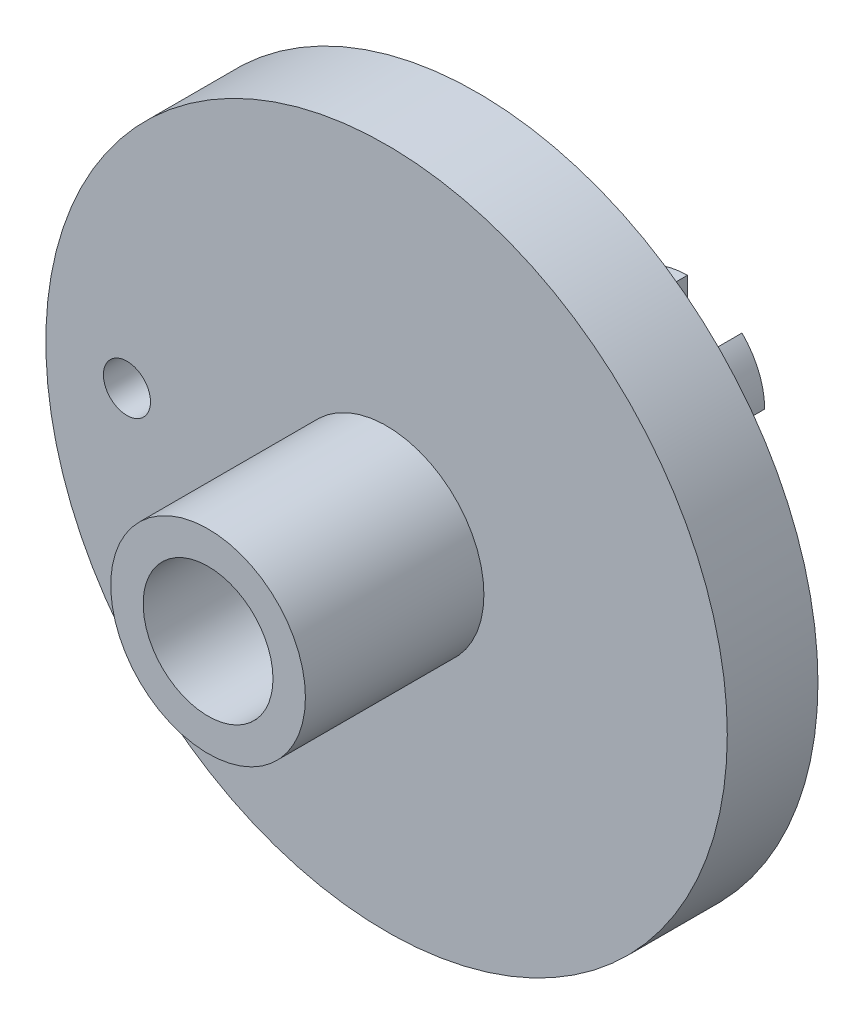
ISO-10303-21;
HEADER;
FILE_DESCRIPTION(('STEP AP214'),'2;1');
FILE_NAME('part.step','',(''),(''),'','','');
FILE_SCHEMA(('AUTOMOTIVE_DESIGN { 1 0 10303 214 1 1 1 1 }'));
ENDSEC;
DATA;
#1=APPLICATION_CONTEXT('core data for automotive mechanical design processes');
#2=APPLICATION_PROTOCOL_DEFINITION('international standard','automotive_design',2000,#1);
#3=PRODUCT_CONTEXT('',#1,'mechanical');
#4=PRODUCT('Part','Part','',(#3));
#5=PRODUCT_RELATED_PRODUCT_CATEGORY('part','',(#4));
#6=PRODUCT_DEFINITION_FORMATION('','',#4);
#7=PRODUCT_DEFINITION_CONTEXT('part definition',#1,'design');
#8=PRODUCT_DEFINITION('design','',#6,#7);
#9=PRODUCT_DEFINITION_SHAPE('','',#8);
#10=(LENGTH_UNIT() NAMED_UNIT(*) SI_UNIT(.MILLI.,.METRE.));
#11=(NAMED_UNIT(*) PLANE_ANGLE_UNIT() SI_UNIT($,.RADIAN.));
#12=(NAMED_UNIT(*) SI_UNIT($,.STERADIAN.) SOLID_ANGLE_UNIT());
#13=UNCERTAINTY_MEASURE_WITH_UNIT(LENGTH_MEASURE(1.E-05),#10,'distance_accuracy_value','');
#14=(GEOMETRIC_REPRESENTATION_CONTEXT(3) GLOBAL_UNCERTAINTY_ASSIGNED_CONTEXT((#13)) GLOBAL_UNIT_ASSIGNED_CONTEXT((#10,
#11,#12)) REPRESENTATION_CONTEXT('',''));
#15=CARTESIAN_POINT('',(0.,0.,0.));
#16=DIRECTION('',(0.,0.,1.));
#17=DIRECTION('',(1.,0.,0.));
#18=AXIS2_PLACEMENT_3D('',#15,#16,#17);
#19=CARTESIAN_POINT('',(0.,0.,0.));
#20=DIRECTION('',(0.,0.,1.));
#21=DIRECTION('',(1.,0.,0.));
#22=AXIS2_PLACEMENT_3D('',#19,#20,#21);
#23=PLANE('',#22);
#24=CARTESIAN_POINT('',(0.,0.,0.));
#25=DIRECTION('',(0.,0.,1.));
#26=DIRECTION('',(1.,0.,0.));
#27=AXIS2_PLACEMENT_3D('',#24,#25,#26);
#28=CIRCLE('',#27,1.55);
#29=CARTESIAN_POINT('',(1.55,0.,0.));
#30=VERTEX_POINT('',#29);
#31=EDGE_CURVE('E491',#30,#30,#28,.T.);
#32=ORIENTED_EDGE('',*,*,#31,.F.);
#33=EDGE_LOOP('',(#32));
#34=FACE_BOUND('',#33,.T.);
#35=CARTESIAN_POINT('',(0.,0.,0.));
#36=DIRECTION('',(0.,0.,1.));
#37=DIRECTION('',(1.,0.,0.));
#38=AXIS2_PLACEMENT_3D('',#35,#36,#37);
#39=CIRCLE('',#38,4.);
#40=CARTESIAN_POINT('',(4.,0.,0.));
#41=VERTEX_POINT('',#40);
#42=EDGE_CURVE('E340',#41,#41,#39,.F.);
#43=ORIENTED_EDGE('',*,*,#42,.F.);
#44=EDGE_LOOP('',(#43));
#45=FACE_BOUND('',#44,.T.);
#46=ADVANCED_FACE('F47',(#34,#45),#23,.T.);
#47=CARTESIAN_POINT('',(0.,0.,-16.));
#48=DIRECTION('',(0.,0.,1.));
#49=DIRECTION('',(1.,0.,0.));
#50=AXIS2_PLACEMENT_3D('',#47,#48,#49);
#51=PLANE('',#50);
#52=CARTESIAN_POINT('',(0.,0.,-16.));
#53=DIRECTION('',(0.,0.,1.));
#54=DIRECTION('',(1.,0.,0.));
#55=AXIS2_PLACEMENT_3D('',#52,#53,#54);
#56=CIRCLE('',#55,1.55);
#57=CARTESIAN_POINT('',(1.55,0.,-16.));
#58=VERTEX_POINT('',#57);
#59=EDGE_CURVE('E193',#58,#58,#56,.T.);
#60=ORIENTED_EDGE('',*,*,#59,.T.);
#61=EDGE_LOOP('',(#60));
#62=FACE_BOUND('',#61,.T.);
#63=DIRECTION('',(0.707106781186551,-0.707106781186544,0.));
#64=VECTOR('',#63,1.);
#65=CARTESIAN_POINT('',(0.,0.,-16.));
#66=LINE('',#65,#64);
#67=CARTESIAN_POINT('',(1.97989898732234,-1.97989898732232,-16.));
#68=VERTEX_POINT('',#67);
#69=CARTESIAN_POINT('',(3.36759604540095,-3.36759604540092,-16.));
#70=VERTEX_POINT('',#69);
#71=EDGE_CURVE('E190',#68,#70,#66,.T.);
#72=ORIENTED_EDGE('',*,*,#71,.F.);
#73=CARTESIAN_POINT('',(0.,0.,-16.));
#74=DIRECTION('',(0.,0.,-1.));
#75=DIRECTION('',(-1.,0.,0.));
#76=AXIS2_PLACEMENT_3D('',#73,#74,#75);
#77=CIRCLE('',#76,2.8);
#78=CARTESIAN_POINT('',(0.,-2.8,-16.));
#79=VERTEX_POINT('',#78);
#80=EDGE_CURVE('E169',#68,#79,#77,.T.);
#81=ORIENTED_EDGE('',*,*,#80,.T.);
#82=DIRECTION('',(0.,1.,0.));
#83=VECTOR('',#82,1.);
#84=CARTESIAN_POINT('',(0.,0.,-16.));
#85=LINE('',#84,#83);
#86=CARTESIAN_POINT('',(0.,-4.7625,-16.));
#87=VERTEX_POINT('',#86);
#88=EDGE_CURVE('E186',#87,#79,#85,.T.);
#89=ORIENTED_EDGE('',*,*,#88,.F.);
#90=CARTESIAN_POINT('',(0.,0.,-16.));
#91=DIRECTION('',(0.,0.,1.));
#92=DIRECTION('',(1.,0.,0.));
#93=AXIS2_PLACEMENT_3D('',#90,#91,#92);
#94=CIRCLE('',#93,4.7625);
#95=CARTESIAN_POINT('',(-3.36759604540093,-3.36759604540094,-16.));
#96=VERTEX_POINT('',#95);
#97=EDGE_CURVE('E504',#96,#87,#94,.T.);
#98=ORIENTED_EDGE('',*,*,#97,.F.);
#99=DIRECTION('',(-0.707106781186546,-0.707106781186549,0.));
#100=VECTOR('',#99,1.);
#101=CARTESIAN_POINT('',(0.,0.,-16.));
#102=LINE('',#101,#100);
#103=CARTESIAN_POINT('',(-1.97989898732233,-1.97989898732234,-16.));
#104=VERTEX_POINT('',#103);
#105=EDGE_CURVE('E231',#104,#96,#102,.T.);
#106=ORIENTED_EDGE('',*,*,#105,.F.);
#107=CARTESIAN_POINT('',(0.,0.,-16.));
#108=DIRECTION('',(0.,0.,-1.));
#109=DIRECTION('',(-1.,0.,0.));
#110=AXIS2_PLACEMENT_3D('',#107,#108,#109);
#111=CIRCLE('',#110,2.8);
#112=CARTESIAN_POINT('',(-2.8,0.,-16.));
#113=VERTEX_POINT('',#112);
#114=EDGE_CURVE('E173',#104,#113,#111,.T.);
#115=ORIENTED_EDGE('',*,*,#114,.T.);
#116=DIRECTION('',(-1.,0.,0.));
#117=VECTOR('',#116,1.);
#118=CARTESIAN_POINT('',(0.,0.,-16.));
#119=LINE('',#118,#117);
#120=CARTESIAN_POINT('',(-4.7625,0.,-16.));
#121=VERTEX_POINT('',#120);
#122=EDGE_CURVE('E217',#113,#121,#119,.T.);
#123=ORIENTED_EDGE('',*,*,#122,.T.);
#124=CARTESIAN_POINT('',(-3.36759604540095,3.36759604540091,-16.));
#125=VERTEX_POINT('',#124);
#126=EDGE_CURVE('E341',#125,#121,#94,.T.);
#127=ORIENTED_EDGE('',*,*,#126,.F.);
#128=DIRECTION('',(0.707106781186551,-0.707106781186544,0.));
#129=VECTOR('',#128,1.);
#130=CARTESIAN_POINT('',(0.,0.,-16.));
#131=LINE('',#130,#129);
#132=CARTESIAN_POINT('',(-1.97989898732234,1.97989898732232,-16.));
#133=VERTEX_POINT('',#132);
#134=EDGE_CURVE('E268',#125,#133,#131,.T.);
#135=ORIENTED_EDGE('',*,*,#134,.T.);
#136=CARTESIAN_POINT('',(0.,0.,-16.));
#137=DIRECTION('',(0.,0.,-1.));
#138=DIRECTION('',(-1.,0.,0.));
#139=AXIS2_PLACEMENT_3D('',#136,#137,#138);
#140=CIRCLE('',#139,2.8);
#141=CARTESIAN_POINT('',(0.,2.8,-16.));
#142=VERTEX_POINT('',#141);
#143=EDGE_CURVE('E247',#133,#142,#140,.T.);
#144=ORIENTED_EDGE('',*,*,#143,.T.);
#145=DIRECTION('',(0.,1.,0.));
#146=VECTOR('',#145,1.);
#147=CARTESIAN_POINT('',(0.,0.,-16.));
#148=LINE('',#147,#146);
#149=CARTESIAN_POINT('',(0.,4.7625,-16.));
#150=VERTEX_POINT('',#149);
#151=EDGE_CURVE('E253',#142,#150,#148,.T.);
#152=ORIENTED_EDGE('',*,*,#151,.T.);
#153=CARTESIAN_POINT('',(3.36759604540093,3.36759604540094,-16.));
#154=VERTEX_POINT('',#153);
#155=EDGE_CURVE('E336',#154,#150,#94,.T.);
#156=ORIENTED_EDGE('',*,*,#155,.F.);
#157=DIRECTION('',(-0.707106781186546,-0.707106781186549,0.));
#158=VECTOR('',#157,1.);
#159=CARTESIAN_POINT('',(0.,0.,-16.));
#160=LINE('',#159,#158);
#161=CARTESIAN_POINT('',(1.97989898732233,1.97989898732234,-16.));
#162=VERTEX_POINT('',#161);
#163=EDGE_CURVE('E307',#154,#162,#160,.T.);
#164=ORIENTED_EDGE('',*,*,#163,.T.);
#165=CARTESIAN_POINT('',(0.,0.,-16.));
#166=DIRECTION('',(0.,0.,-1.));
#167=DIRECTION('',(-1.,0.,0.));
#168=AXIS2_PLACEMENT_3D('',#165,#166,#167);
#169=CIRCLE('',#168,2.8);
#170=CARTESIAN_POINT('',(2.8,0.,-16.));
#171=VERTEX_POINT('',#170);
#172=EDGE_CURVE('E287',#162,#171,#169,.T.);
#173=ORIENTED_EDGE('',*,*,#172,.T.);
#174=DIRECTION('',(-1.,0.,0.));
#175=VECTOR('',#174,1.);
#176=CARTESIAN_POINT('',(0.,0.,-16.));
#177=LINE('',#176,#175);
#178=CARTESIAN_POINT('',(4.7625,0.,-16.));
#179=VERTEX_POINT('',#178);
#180=EDGE_CURVE('E293',#179,#171,#177,.T.);
#181=ORIENTED_EDGE('',*,*,#180,.F.);
#182=EDGE_CURVE('E332',#70,#179,#94,.T.);
#183=ORIENTED_EDGE('',*,*,#182,.F.);
#184=EDGE_LOOP('',(#72,#81,#89,#98,#106,#115,#123,#127,#135,#144,#152,#156,#164,#173,#181,#183));
#185=FACE_BOUND('',#184,.T.);
#186=ADVANCED_FACE('F362',(#62,#185),#51,.F.);
#187=CARTESIAN_POINT('',(0.,0.,-16.));
#188=DIRECTION('',(0.,0.,1.));
#189=DIRECTION('',(1.,0.,0.));
#190=AXIS2_PLACEMENT_3D('',#187,#188,#189);
#191=CYLINDRICAL_SURFACE('',#190,4.7625);
#192=CARTESIAN_POINT('',(0.,0.,-7.588));
#193=DIRECTION('',(0.,0.,1.));
#194=DIRECTION('',(1.,0.,0.));
#195=AXIS2_PLACEMENT_3D('',#192,#193,#194);
#196=CIRCLE('',#195,4.7625);
#197=CARTESIAN_POINT('',(4.7625,0.,-7.588));
#198=VERTEX_POINT('',#197);
#199=EDGE_CURVE('E56',#198,#198,#196,.F.);
#200=ORIENTED_EDGE('',*,*,#199,.T.);
#201=EDGE_LOOP('',(#200));
#202=FACE_BOUND('',#201,.T.);
#203=ORIENTED_EDGE('',*,*,#155,.T.);
#204=DIRECTION('',(0.,0.,1.));
#205=VECTOR('',#204,1.);
#206=CARTESIAN_POINT('',(0.,4.7625,-18.54));
#207=LINE('',#206,#205);
#208=CARTESIAN_POINT('',(0.,4.7625,-18.54));
#209=VERTEX_POINT('',#208);
#210=EDGE_CURVE('E277',#209,#150,#207,.T.);
#211=ORIENTED_EDGE('',*,*,#210,.F.);
#212=CARTESIAN_POINT('',(0.,0.,-18.54));
#213=DIRECTION('',(0.,0.,-1.));
#214=DIRECTION('',(-1.,0.,0.));
#215=AXIS2_PLACEMENT_3D('',#212,#213,#214);
#216=CIRCLE('',#215,4.7625);
#217=CARTESIAN_POINT('',(-3.36759604540095,3.36759604540091,-18.54));
#218=VERTEX_POINT('',#217);
#219=EDGE_CURVE('E257',#218,#209,#216,.T.);
#220=ORIENTED_EDGE('',*,*,#219,.F.);
#221=DIRECTION('',(0.,0.,1.));
#222=VECTOR('',#221,1.);
#223=CARTESIAN_POINT('',(-3.36759604540095,3.36759604540091,-18.54));
#224=LINE('',#223,#222);
#225=EDGE_CURVE('E280',#218,#125,#224,.T.);
#226=ORIENTED_EDGE('',*,*,#225,.T.);
#227=ORIENTED_EDGE('',*,*,#126,.T.);
#228=DIRECTION('',(0.,0.,1.));
#229=VECTOR('',#228,1.);
#230=CARTESIAN_POINT('',(-4.7625,0.,-18.54));
#231=LINE('',#230,#229);
#232=CARTESIAN_POINT('',(-4.7625,0.,-18.54));
#233=VERTEX_POINT('',#232);
#234=EDGE_CURVE('E239',#233,#121,#231,.T.);
#235=ORIENTED_EDGE('',*,*,#234,.F.);
#236=CARTESIAN_POINT('',(0.,0.,-18.54));
#237=DIRECTION('',(0.,0.,-1.));
#238=DIRECTION('',(-1.,0.,0.));
#239=AXIS2_PLACEMENT_3D('',#236,#237,#238);
#240=CIRCLE('',#239,4.7625);
#241=CARTESIAN_POINT('',(-3.36759604540093,-3.36759604540094,-18.54));
#242=VERTEX_POINT('',#241);
#243=EDGE_CURVE('E220',#242,#233,#240,.T.);
#244=ORIENTED_EDGE('',*,*,#243,.F.);
#245=DIRECTION('',(0.,0.,1.));
#246=VECTOR('',#245,1.);
#247=CARTESIAN_POINT('',(-3.36759604540093,-3.36759604540094,-18.54));
#248=LINE('',#247,#246);
#249=EDGE_CURVE('E70',#242,#96,#248,.T.);
#250=ORIENTED_EDGE('',*,*,#249,.T.);
#251=ORIENTED_EDGE('',*,*,#97,.T.);
#252=DIRECTION('',(0.,0.,1.));
#253=VECTOR('',#252,1.);
#254=CARTESIAN_POINT('',(0.,-4.7625,-18.54));
#255=LINE('',#254,#253);
#256=CARTESIAN_POINT('',(0.,-4.7625,-18.54));
#257=VERTEX_POINT('',#256);
#258=EDGE_CURVE('E207',#257,#87,#255,.T.);
#259=ORIENTED_EDGE('',*,*,#258,.F.);
#260=CARTESIAN_POINT('',(0.,0.,-18.54));
#261=DIRECTION('',(0.,0.,-1.));
#262=DIRECTION('',(-1.,0.,0.));
#263=AXIS2_PLACEMENT_3D('',#260,#261,#262);
#264=CIRCLE('',#263,4.7625);
#265=CARTESIAN_POINT('',(3.36759604540095,-3.36759604540092,-18.54));
#266=VERTEX_POINT('',#265);
#267=EDGE_CURVE('E179',#266,#257,#264,.T.);
#268=ORIENTED_EDGE('',*,*,#267,.F.);
#269=DIRECTION('',(0.,0.,1.));
#270=VECTOR('',#269,1.);
#271=CARTESIAN_POINT('',(3.36759604540095,-3.36759604540092,-18.54));
#272=LINE('',#271,#270);
#273=EDGE_CURVE('E63',#266,#70,#272,.T.);
#274=ORIENTED_EDGE('',*,*,#273,.T.);
#275=ORIENTED_EDGE('',*,*,#182,.T.);
#276=DIRECTION('',(0.,0.,1.));
#277=VECTOR('',#276,1.);
#278=CARTESIAN_POINT('',(4.7625,0.,-18.54));
#279=LINE('',#278,#277);
#280=CARTESIAN_POINT('',(4.7625,0.,-18.54));
#281=VERTEX_POINT('',#280);
#282=EDGE_CURVE('E316',#281,#179,#279,.T.);
#283=ORIENTED_EDGE('',*,*,#282,.F.);
#284=CARTESIAN_POINT('',(0.,0.,-18.54));
#285=DIRECTION('',(0.,0.,-1.));
#286=DIRECTION('',(-1.,0.,0.));
#287=AXIS2_PLACEMENT_3D('',#284,#285,#286);
#288=CIRCLE('',#287,4.7625);
#289=CARTESIAN_POINT('',(3.36759604540093,3.36759604540094,-18.54));
#290=VERTEX_POINT('',#289);
#291=EDGE_CURVE('E297',#290,#281,#288,.T.);
#292=ORIENTED_EDGE('',*,*,#291,.F.);
#293=DIRECTION('',(0.,0.,1.));
#294=VECTOR('',#293,1.);
#295=CARTESIAN_POINT('',(3.36759604540093,3.36759604540094,-18.54));
#296=LINE('',#295,#294);
#297=EDGE_CURVE('E320',#290,#154,#296,.T.);
#298=ORIENTED_EDGE('',*,*,#297,.T.);
#299=EDGE_LOOP('',(#203,#211,#220,#226,#227,#235,#244,#250,#251,#259,#268,#274,#275,#283,#292,#298));
#300=FACE_BOUND('',#299,.T.);
#301=ADVANCED_FACE('F348',(#202,#300),#191,.T.);
#302=CARTESIAN_POINT('',(0.,0.,-5.588));
#303=DIRECTION('',(0.,0.,1.));
#304=DIRECTION('',(1.,0.,0.));
#305=AXIS2_PLACEMENT_3D('',#302,#303,#304);
#306=CYLINDRICAL_SURFACE('',#305,21.);
#307=CARTESIAN_POINT('',(0.,0.,-5.588));
#308=DIRECTION('',(0.,0.,1.));
#309=DIRECTION('',(1.,0.,0.));
#310=AXIS2_PLACEMENT_3D('',#307,#308,#309);
#311=CIRCLE('',#310,21.);
#312=CARTESIAN_POINT('',(21.,0.,-5.588));
#313=VERTEX_POINT('',#312);
#314=EDGE_CURVE('E328',#313,#313,#311,.T.);
#315=ORIENTED_EDGE('',*,*,#314,.T.);
#316=EDGE_LOOP('',(#315));
#317=FACE_BOUND('',#316,.T.);
#318=CARTESIAN_POINT('',(0.,0.,0.));
#319=DIRECTION('',(0.,0.,1.));
#320=DIRECTION('',(1.,0.,0.));
#321=AXIS2_PLACEMENT_3D('',#318,#319,#320);
#322=CIRCLE('',#321,21.);
#323=CARTESIAN_POINT('',(21.,0.,0.));
#324=VERTEX_POINT('',#323);
#325=EDGE_CURVE('E327',#324,#324,#322,.T.);
#326=ORIENTED_EDGE('',*,*,#325,.F.);
#327=EDGE_LOOP('',(#326));
#328=FACE_BOUND('',#327,.T.);
#329=ADVANCED_FACE('F385',(#317,#328),#306,.T.);
#330=CARTESIAN_POINT('',(0.,0.,-5.588));
#331=DIRECTION('',(0.,0.,1.));
#332=DIRECTION('',(1.,0.,0.));
#333=AXIS2_PLACEMENT_3D('',#330,#331,#332);
#334=PLANE('',#333);
#335=CARTESIAN_POINT('',(0.,0.,-5.588));
#336=DIRECTION('',(0.,0.,1.));
#337=DIRECTION('',(1.,0.,0.));
#338=AXIS2_PLACEMENT_3D('',#335,#336,#337);
#339=CIRCLE('',#338,6.7625);
#340=CARTESIAN_POINT('',(6.7625,0.,-5.588));
#341=VERTEX_POINT('',#340);
#342=EDGE_CURVE('E11',#341,#341,#339,.T.);
#343=ORIENTED_EDGE('',*,*,#342,.T.);
#344=EDGE_LOOP('',(#343));
#345=FACE_BOUND('',#344,.T.);
#346=CARTESIAN_POINT('',(-16.,0.,-5.588));
#347=DIRECTION('',(0.,0.,1.));
#348=DIRECTION('',(1.,0.,0.));
#349=AXIS2_PLACEMENT_3D('',#346,#347,#348);
#350=CIRCLE('',#349,1.45);
#351=CARTESIAN_POINT('',(-14.55,0.,-5.588));
#352=VERTEX_POINT('',#351);
#353=EDGE_CURVE('E488',#352,#352,#350,.T.);
#354=ORIENTED_EDGE('',*,*,#353,.T.);
#355=EDGE_LOOP('',(#354));
#356=FACE_BOUND('',#355,.T.);
#357=ORIENTED_EDGE('',*,*,#314,.F.);
#358=EDGE_LOOP('',(#357));
#359=FACE_BOUND('',#358,.T.);
#360=ADVANCED_FACE('F376',(#345,#356,#359),#334,.F.);
#361=CARTESIAN_POINT('',(0.,0.,0.));
#362=DIRECTION('',(0.,0.,1.));
#363=DIRECTION('',(1.,0.,0.));
#364=AXIS2_PLACEMENT_3D('',#361,#362,#363);
#365=CIRCLE('',#364,6.);
#366=CARTESIAN_POINT('',(6.,0.,0.));
#367=VERTEX_POINT('',#366);
#368=EDGE_CURVE('E391',#367,#367,#365,.T.);
#369=ORIENTED_EDGE('',*,*,#368,.F.);
#370=EDGE_LOOP('',(#369));
#371=FACE_BOUND('',#370,.T.);
#372=CARTESIAN_POINT('',(-16.,0.,0.));
#373=DIRECTION('',(0.,0.,1.));
#374=DIRECTION('',(1.,0.,0.));
#375=AXIS2_PLACEMENT_3D('',#372,#373,#374);
#376=CIRCLE('',#375,1.45);
#377=CARTESIAN_POINT('',(-14.55,0.,0.));
#378=VERTEX_POINT('',#377);
#379=EDGE_CURVE('E395',#378,#378,#376,.T.);
#380=ORIENTED_EDGE('',*,*,#379,.F.);
#381=EDGE_LOOP('',(#380));
#382=FACE_BOUND('',#381,.T.);
#383=ORIENTED_EDGE('',*,*,#325,.T.);
#384=EDGE_LOOP('',(#383));
#385=FACE_BOUND('',#384,.T.);
#386=ADVANCED_FACE('F365',(#371,#382,#385),#23,.T.);
#387=CARTESIAN_POINT('',(0.,0.,-18.54));
#388=DIRECTION('',(0.,0.,1.));
#389=DIRECTION('',(1.,0.,0.));
#390=AXIS2_PLACEMENT_3D('',#387,#388,#389);
#391=CYLINDRICAL_SURFACE('',#390,2.8);
#392=ORIENTED_EDGE('',*,*,#172,.F.);
#393=DIRECTION('',(0.,0.,1.));
#394=VECTOR('',#393,1.);
#395=CARTESIAN_POINT('',(1.97989898732233,1.97989898732234,-18.54));
#396=LINE('',#395,#394);
#397=CARTESIAN_POINT('',(1.97989898732233,1.97989898732234,-18.54));
#398=VERTEX_POINT('',#397);
#399=EDGE_CURVE('E323',#398,#162,#396,.T.);
#400=ORIENTED_EDGE('',*,*,#399,.F.);
#401=CARTESIAN_POINT('',(0.,0.,-18.54));
#402=DIRECTION('',(0.,0.,-1.));
#403=DIRECTION('',(-1.,0.,0.));
#404=AXIS2_PLACEMENT_3D('',#401,#402,#403);
#405=CIRCLE('',#404,2.8);
#406=CARTESIAN_POINT('',(2.8,0.,-18.54));
#407=VERTEX_POINT('',#406);
#408=EDGE_CURVE('E288',#398,#407,#405,.T.);
#409=ORIENTED_EDGE('',*,*,#408,.T.);
#410=DIRECTION('',(0.,0.,1.));
#411=VECTOR('',#410,1.);
#412=CARTESIAN_POINT('',(2.8,0.,-18.54));
#413=LINE('',#412,#411);
#414=EDGE_CURVE('E303',#407,#171,#413,.T.);
#415=ORIENTED_EDGE('',*,*,#414,.T.);
#416=EDGE_LOOP('',(#392,#400,#409,#415));
#417=FACE_BOUND('',#416,.T.);
#418=ADVANCED_FACE('F375',(#417),#391,.F.);
#419=CARTESIAN_POINT('',(0.,0.,-18.54));
#420=DIRECTION('',(-0.707106781186549,0.707106781186546,0.));
#421=DIRECTION('',(-0.707106781186546,-0.707106781186549,0.));
#422=AXIS2_PLACEMENT_3D('',#419,#420,#421);
#423=PLANE('',#422);
#424=ORIENTED_EDGE('',*,*,#163,.F.);
#425=ORIENTED_EDGE('',*,*,#297,.F.);
#426=DIRECTION('',(-0.707106781186546,-0.707106781186549,0.));
#427=VECTOR('',#426,1.);
#428=CARTESIAN_POINT('',(0.,0.,-18.54));
#429=LINE('',#428,#427);
#430=EDGE_CURVE('E292',#290,#398,#429,.T.);
#431=ORIENTED_EDGE('',*,*,#430,.T.);
#432=ORIENTED_EDGE('',*,*,#399,.T.);
#433=EDGE_LOOP('',(#424,#425,#431,#432));
#434=FACE_BOUND('',#433,.T.);
#435=ADVANCED_FACE('F382',(#434),#423,.T.);
#436=CARTESIAN_POINT('',(0.,0.,-18.54));
#437=DIRECTION('',(0.,1.,0.));
#438=DIRECTION('',(0.,0.,1.));
#439=AXIS2_PLACEMENT_3D('',#436,#437,#438);
#440=PLANE('',#439);
#441=ORIENTED_EDGE('',*,*,#180,.T.);
#442=ORIENTED_EDGE('',*,*,#414,.F.);
#443=DIRECTION('',(-1.,0.,0.));
#444=VECTOR('',#443,1.);
#445=CARTESIAN_POINT('',(0.,0.,-18.54));
#446=LINE('',#445,#444);
#447=EDGE_CURVE('E300',#281,#407,#446,.T.);
#448=ORIENTED_EDGE('',*,*,#447,.F.);
#449=ORIENTED_EDGE('',*,*,#282,.T.);
#450=EDGE_LOOP('',(#441,#442,#448,#449));
#451=FACE_BOUND('',#450,.T.);
#452=ADVANCED_FACE('F407',(#451),#440,.F.);
#453=CARTESIAN_POINT('',(0.,0.,-18.54));
#454=DIRECTION('',(0.,0.,-1.));
#455=DIRECTION('',(-1.,0.,0.));
#456=AXIS2_PLACEMENT_3D('',#453,#454,#455);
#457=PLANE('',#456);
#458=ORIENTED_EDGE('',*,*,#408,.F.);
#459=ORIENTED_EDGE('',*,*,#430,.F.);
#460=ORIENTED_EDGE('',*,*,#291,.T.);
#461=ORIENTED_EDGE('',*,*,#447,.T.);
#462=EDGE_LOOP('',(#458,#459,#460,#461));
#463=FACE_BOUND('',#462,.T.);
#464=ADVANCED_FACE('F411',(#463),#457,.T.);
#465=CARTESIAN_POINT('',(0.,0.,-18.54));
#466=DIRECTION('',(0.,0.,1.));
#467=DIRECTION('',(1.,0.,0.));
#468=AXIS2_PLACEMENT_3D('',#465,#466,#467);
#469=CYLINDRICAL_SURFACE('',#468,2.8);
#470=ORIENTED_EDGE('',*,*,#143,.F.);
#471=DIRECTION('',(0.,0.,1.));
#472=VECTOR('',#471,1.);
#473=CARTESIAN_POINT('',(-1.97989898732234,1.97989898732232,-18.54));
#474=LINE('',#473,#472);
#475=CARTESIAN_POINT('',(-1.97989898732234,1.97989898732232,-18.54));
#476=VERTEX_POINT('',#475);
#477=EDGE_CURVE('E284',#476,#133,#474,.T.);
#478=ORIENTED_EDGE('',*,*,#477,.F.);
#479=CARTESIAN_POINT('',(0.,0.,-18.54));
#480=DIRECTION('',(0.,0.,-1.));
#481=DIRECTION('',(-1.,0.,0.));
#482=AXIS2_PLACEMENT_3D('',#479,#480,#481);
#483=CIRCLE('',#482,2.8);
#484=CARTESIAN_POINT('',(0.,2.8,-18.54));
#485=VERTEX_POINT('',#484);
#486=EDGE_CURVE('E248',#476,#485,#483,.T.);
#487=ORIENTED_EDGE('',*,*,#486,.T.);
#488=DIRECTION('',(0.,0.,1.));
#489=VECTOR('',#488,1.);
#490=CARTESIAN_POINT('',(0.,2.8,-18.54));
#491=LINE('',#490,#489);
#492=EDGE_CURVE('E264',#485,#142,#491,.T.);
#493=ORIENTED_EDGE('',*,*,#492,.T.);
#494=EDGE_LOOP('',(#470,#478,#487,#493));
#495=FACE_BOUND('',#494,.T.);
#496=ADVANCED_FACE('F415',(#495),#469,.F.);
#497=CARTESIAN_POINT('',(0.,0.,-18.54));
#498=DIRECTION('',(-0.707106781186544,-0.707106781186551,0.));
#499=DIRECTION('',(0.707106781186551,-0.707106781186544,0.));
#500=AXIS2_PLACEMENT_3D('',#497,#498,#499);
#501=PLANE('',#500);
#502=ORIENTED_EDGE('',*,*,#134,.F.);
#503=ORIENTED_EDGE('',*,*,#225,.F.);
#504=DIRECTION('',(0.707106781186551,-0.707106781186544,0.));
#505=VECTOR('',#504,1.);
#506=CARTESIAN_POINT('',(0.,0.,-18.54));
#507=LINE('',#506,#505);
#508=EDGE_CURVE('E252',#218,#476,#507,.T.);
#509=ORIENTED_EDGE('',*,*,#508,.T.);
#510=ORIENTED_EDGE('',*,*,#477,.T.);
#511=EDGE_LOOP('',(#502,#503,#509,#510));
#512=FACE_BOUND('',#511,.T.);
#513=ADVANCED_FACE('F419',(#512),#501,.T.);
#514=CARTESIAN_POINT('',(0.,0.,-18.54));
#515=DIRECTION('',(1.,0.,0.));
#516=DIRECTION('',(0.,0.,-1.));
#517=AXIS2_PLACEMENT_3D('',#514,#515,#516);
#518=PLANE('',#517);
#519=ORIENTED_EDGE('',*,*,#151,.F.);
#520=ORIENTED_EDGE('',*,*,#492,.F.);
#521=DIRECTION('',(0.,1.,0.));
#522=VECTOR('',#521,1.);
#523=CARTESIAN_POINT('',(0.,0.,-18.54));
#524=LINE('',#523,#522);
#525=EDGE_CURVE('E260',#485,#209,#524,.T.);
#526=ORIENTED_EDGE('',*,*,#525,.T.);
#527=ORIENTED_EDGE('',*,*,#210,.T.);
#528=EDGE_LOOP('',(#519,#520,#526,#527));
#529=FACE_BOUND('',#528,.T.);
#530=ADVANCED_FACE('F423',(#529),#518,.T.);
#531=CARTESIAN_POINT('',(0.,0.,-18.54));
#532=DIRECTION('',(0.,0.,-1.));
#533=DIRECTION('',(-1.,0.,0.));
#534=AXIS2_PLACEMENT_3D('',#531,#532,#533);
#535=PLANE('',#534);
#536=ORIENTED_EDGE('',*,*,#486,.F.);
#537=ORIENTED_EDGE('',*,*,#508,.F.);
#538=ORIENTED_EDGE('',*,*,#219,.T.);
#539=ORIENTED_EDGE('',*,*,#525,.F.);
#540=EDGE_LOOP('',(#536,#537,#538,#539));
#541=FACE_BOUND('',#540,.T.);
#542=ADVANCED_FACE('F427',(#541),#535,.T.);
#543=CARTESIAN_POINT('',(0.,0.,-18.54));
#544=DIRECTION('',(0.,0.,1.));
#545=DIRECTION('',(1.,0.,0.));
#546=AXIS2_PLACEMENT_3D('',#543,#544,#545);
#547=CYLINDRICAL_SURFACE('',#546,2.8);
#548=ORIENTED_EDGE('',*,*,#114,.F.);
#549=DIRECTION('',(0.,0.,1.));
#550=VECTOR('',#549,1.);
#551=CARTESIAN_POINT('',(-1.97989898732233,-1.97989898732234,-18.54));
#552=LINE('',#551,#550);
#553=CARTESIAN_POINT('',(-1.97989898732233,-1.97989898732234,-18.54));
#554=VERTEX_POINT('',#553);
#555=EDGE_CURVE('E244',#554,#104,#552,.T.);
#556=ORIENTED_EDGE('',*,*,#555,.F.);
#557=CARTESIAN_POINT('',(0.,0.,-18.54));
#558=DIRECTION('',(0.,0.,-1.));
#559=DIRECTION('',(-1.,0.,0.));
#560=AXIS2_PLACEMENT_3D('',#557,#558,#559);
#561=CIRCLE('',#560,2.8);
#562=CARTESIAN_POINT('',(-2.8,0.,-18.54));
#563=VERTEX_POINT('',#562);
#564=EDGE_CURVE('E212',#554,#563,#561,.T.);
#565=ORIENTED_EDGE('',*,*,#564,.T.);
#566=DIRECTION('',(0.,0.,1.));
#567=VECTOR('',#566,1.);
#568=CARTESIAN_POINT('',(-2.8,0.,-18.54));
#569=LINE('',#568,#567);
#570=EDGE_CURVE('E227',#563,#113,#569,.T.);
#571=ORIENTED_EDGE('',*,*,#570,.T.);
#572=EDGE_LOOP('',(#548,#556,#565,#571));
#573=FACE_BOUND('',#572,.T.);
#574=ADVANCED_FACE('F431',(#573),#547,.F.);
#575=CARTESIAN_POINT('',(0.,0.,-18.54));
#576=DIRECTION('',(-0.707106781186549,0.707106781186546,0.));
#577=DIRECTION('',(-0.707106781186546,-0.707106781186549,0.));
#578=AXIS2_PLACEMENT_3D('',#575,#576,#577);
#579=PLANE('',#578);
#580=ORIENTED_EDGE('',*,*,#105,.T.);
#581=ORIENTED_EDGE('',*,*,#249,.F.);
#582=DIRECTION('',(-0.707106781186546,-0.707106781186549,0.));
#583=VECTOR('',#582,1.);
#584=CARTESIAN_POINT('',(0.,0.,-18.54));
#585=LINE('',#584,#583);
#586=EDGE_CURVE('E216',#554,#242,#585,.T.);
#587=ORIENTED_EDGE('',*,*,#586,.F.);
#588=ORIENTED_EDGE('',*,*,#555,.T.);
#589=EDGE_LOOP('',(#580,#581,#587,#588));
#590=FACE_BOUND('',#589,.T.);
#591=ADVANCED_FACE('F435',(#590),#579,.F.);
#592=CARTESIAN_POINT('',(0.,0.,-18.54));
#593=DIRECTION('',(0.,1.,0.));
#594=DIRECTION('',(0.,0.,1.));
#595=AXIS2_PLACEMENT_3D('',#592,#593,#594);
#596=PLANE('',#595);
#597=ORIENTED_EDGE('',*,*,#122,.F.);
#598=ORIENTED_EDGE('',*,*,#570,.F.);
#599=DIRECTION('',(-1.,0.,0.));
#600=VECTOR('',#599,1.);
#601=CARTESIAN_POINT('',(0.,0.,-18.54));
#602=LINE('',#601,#600);
#603=EDGE_CURVE('E223',#563,#233,#602,.T.);
#604=ORIENTED_EDGE('',*,*,#603,.T.);
#605=ORIENTED_EDGE('',*,*,#234,.T.);
#606=EDGE_LOOP('',(#597,#598,#604,#605));
#607=FACE_BOUND('',#606,.T.);
#608=ADVANCED_FACE('F439',(#607),#596,.T.);
#609=CARTESIAN_POINT('',(0.,0.,-18.54));
#610=DIRECTION('',(0.,0.,-1.));
#611=DIRECTION('',(-1.,0.,0.));
#612=AXIS2_PLACEMENT_3D('',#609,#610,#611);
#613=PLANE('',#612);
#614=ORIENTED_EDGE('',*,*,#564,.F.);
#615=ORIENTED_EDGE('',*,*,#586,.T.);
#616=ORIENTED_EDGE('',*,*,#243,.T.);
#617=ORIENTED_EDGE('',*,*,#603,.F.);
#618=EDGE_LOOP('',(#614,#615,#616,#617));
#619=FACE_BOUND('',#618,.T.);
#620=ADVANCED_FACE('F443',(#619),#613,.T.);
#621=CARTESIAN_POINT('',(0.,0.,-18.54));
#622=DIRECTION('',(0.,0.,1.));
#623=DIRECTION('',(1.,0.,0.));
#624=AXIS2_PLACEMENT_3D('',#621,#622,#623);
#625=CYLINDRICAL_SURFACE('',#624,2.8);
#626=ORIENTED_EDGE('',*,*,#80,.F.);
#627=DIRECTION('',(0.,0.,1.));
#628=VECTOR('',#627,1.);
#629=CARTESIAN_POINT('',(1.97989898732234,-1.97989898732232,-18.54));
#630=LINE('',#629,#628);
#631=CARTESIAN_POINT('',(1.97989898732234,-1.97989898732232,-18.54));
#632=VERTEX_POINT('',#631);
#633=EDGE_CURVE('E163',#632,#68,#630,.T.);
#634=ORIENTED_EDGE('',*,*,#633,.F.);
#635=CARTESIAN_POINT('',(0.,0.,-18.54));
#636=DIRECTION('',(0.,0.,-1.));
#637=DIRECTION('',(-1.,0.,0.));
#638=AXIS2_PLACEMENT_3D('',#635,#636,#637);
#639=CIRCLE('',#638,2.8);
#640=CARTESIAN_POINT('',(0.,-2.8,-18.54));
#641=VERTEX_POINT('',#640);
#642=EDGE_CURVE('E167',#632,#641,#639,.T.);
#643=ORIENTED_EDGE('',*,*,#642,.T.);
#644=DIRECTION('',(0.,0.,1.));
#645=VECTOR('',#644,1.);
#646=CARTESIAN_POINT('',(0.,-2.8,-18.54));
#647=LINE('',#646,#645);
#648=EDGE_CURVE('E200',#641,#79,#647,.T.);
#649=ORIENTED_EDGE('',*,*,#648,.T.);
#650=EDGE_LOOP('',(#626,#634,#643,#649));
#651=FACE_BOUND('',#650,.T.);
#652=ADVANCED_FACE('F165',(#651),#625,.F.);
#653=CARTESIAN_POINT('',(0.,0.,-18.54));
#654=DIRECTION('',(-0.707106781186544,-0.707106781186551,0.));
#655=DIRECTION('',(0.707106781186551,-0.707106781186544,0.));
#656=AXIS2_PLACEMENT_3D('',#653,#654,#655);
#657=PLANE('',#656);
#658=ORIENTED_EDGE('',*,*,#71,.T.);
#659=ORIENTED_EDGE('',*,*,#273,.F.);
#660=DIRECTION('',(0.707106781186551,-0.707106781186544,0.));
#661=VECTOR('',#660,1.);
#662=CARTESIAN_POINT('',(0.,0.,-18.54));
#663=LINE('',#662,#661);
#664=EDGE_CURVE('E175',#632,#266,#663,.T.);
#665=ORIENTED_EDGE('',*,*,#664,.F.);
#666=ORIENTED_EDGE('',*,*,#633,.T.);
#667=EDGE_LOOP('',(#658,#659,#665,#666));
#668=FACE_BOUND('',#667,.T.);
#669=ADVANCED_FACE('F176',(#668),#657,.F.);
#670=CARTESIAN_POINT('',(0.,0.,-18.54));
#671=DIRECTION('',(1.,0.,0.));
#672=DIRECTION('',(0.,0.,-1.));
#673=AXIS2_PLACEMENT_3D('',#670,#671,#672);
#674=PLANE('',#673);
#675=ORIENTED_EDGE('',*,*,#88,.T.);
#676=ORIENTED_EDGE('',*,*,#648,.F.);
#677=DIRECTION('',(0.,1.,0.));
#678=VECTOR('',#677,1.);
#679=CARTESIAN_POINT('',(0.,0.,-18.54));
#680=LINE('',#679,#678);
#681=EDGE_CURVE('E183',#257,#641,#680,.T.);
#682=ORIENTED_EDGE('',*,*,#681,.F.);
#683=ORIENTED_EDGE('',*,*,#258,.T.);
#684=EDGE_LOOP('',(#675,#676,#682,#683));
#685=FACE_BOUND('',#684,.T.);
#686=ADVANCED_FACE('F452',(#685),#674,.F.);
#687=CARTESIAN_POINT('',(0.,0.,-18.54));
#688=DIRECTION('',(0.,0.,-1.));
#689=DIRECTION('',(-1.,0.,0.));
#690=AXIS2_PLACEMENT_3D('',#687,#688,#689);
#691=PLANE('',#690);
#692=ORIENTED_EDGE('',*,*,#642,.F.);
#693=ORIENTED_EDGE('',*,*,#664,.T.);
#694=ORIENTED_EDGE('',*,*,#267,.T.);
#695=ORIENTED_EDGE('',*,*,#681,.T.);
#696=EDGE_LOOP('',(#692,#693,#694,#695));
#697=FACE_BOUND('',#696,.T.);
#698=ADVANCED_FACE('F181',(#697),#691,.T.);
#699=CARTESIAN_POINT('',(0.,0.,-18.54));
#700=DIRECTION('',(0.,0.,1.));
#701=DIRECTION('',(1.,0.,0.));
#702=AXIS2_PLACEMENT_3D('',#699,#700,#701);
#703=CYLINDRICAL_SURFACE('',#702,1.55);
#704=ORIENTED_EDGE('',*,*,#31,.T.);
#705=EDGE_LOOP('',(#704));
#706=FACE_BOUND('',#705,.T.);
#707=ORIENTED_EDGE('',*,*,#59,.F.);
#708=EDGE_LOOP('',(#707));
#709=FACE_BOUND('',#708,.T.);
#710=ADVANCED_FACE('F458',(#706,#709),#703,.F.);
#711=CARTESIAN_POINT('',(-16.,0.,-7.62));
#712=DIRECTION('',(0.,0.,1.));
#713=DIRECTION('',(1.,0.,0.));
#714=AXIS2_PLACEMENT_3D('',#711,#712,#713);
#715=CYLINDRICAL_SURFACE('',#714,1.45);
#716=ORIENTED_EDGE('',*,*,#379,.T.);
#717=EDGE_LOOP('',(#716));
#718=FACE_BOUND('',#717,.T.);
#719=ORIENTED_EDGE('',*,*,#353,.F.);
#720=EDGE_LOOP('',(#719));
#721=FACE_BOUND('',#720,.T.);
#722=ADVANCED_FACE('F461',(#718,#721),#715,.F.);
#723=CARTESIAN_POINT('',(0.,0.,11.));
#724=DIRECTION('',(0.,0.,1.));
#725=DIRECTION('',(1.,0.,0.));
#726=AXIS2_PLACEMENT_3D('',#723,#724,#725);
#727=PLANE('',#726);
#728=CARTESIAN_POINT('',(0.,0.,11.));
#729=DIRECTION('',(0.,0.,1.));
#730=DIRECTION('',(1.,0.,0.));
#731=AXIS2_PLACEMENT_3D('',#728,#729,#730);
#732=CIRCLE('',#731,6.);
#733=CARTESIAN_POINT('',(6.,0.,11.));
#734=VERTEX_POINT('',#733);
#735=EDGE_CURVE('E475',#734,#734,#732,.T.);
#736=ORIENTED_EDGE('',*,*,#735,.T.);
#737=EDGE_LOOP('',(#736));
#738=FACE_BOUND('',#737,.T.);
#739=CARTESIAN_POINT('',(0.,0.,11.));
#740=DIRECTION('',(0.,0.,1.));
#741=DIRECTION('',(1.,0.,0.));
#742=AXIS2_PLACEMENT_3D('',#739,#740,#741);
#743=CIRCLE('',#742,4.);
#744=CARTESIAN_POINT('',(4.,0.,11.));
#745=VERTEX_POINT('',#744);
#746=EDGE_CURVE('E478',#745,#745,#743,.T.);
#747=ORIENTED_EDGE('',*,*,#746,.F.);
#748=EDGE_LOOP('',(#747));
#749=FACE_BOUND('',#748,.T.);
#750=ADVANCED_FACE('F464',(#738,#749),#727,.T.);
#751=CARTESIAN_POINT('',(0.,0.,11.));
#752=DIRECTION('',(0.,0.,-1.));
#753=DIRECTION('',(-1.,0.,0.));
#754=AXIS2_PLACEMENT_3D('',#751,#752,#753);
#755=CYLINDRICAL_SURFACE('',#754,6.);
#756=ORIENTED_EDGE('',*,*,#735,.F.);
#757=EDGE_LOOP('',(#756));
#758=FACE_BOUND('',#757,.T.);
#759=ORIENTED_EDGE('',*,*,#368,.T.);
#760=EDGE_LOOP('',(#759));
#761=FACE_BOUND('',#760,.T.);
#762=ADVANCED_FACE('F357',(#758,#761),#755,.T.);
#763=CARTESIAN_POINT('',(0.,0.,11.));
#764=DIRECTION('',(0.,0.,-1.));
#765=DIRECTION('',(-1.,0.,0.));
#766=AXIS2_PLACEMENT_3D('',#763,#764,#765);
#767=CYLINDRICAL_SURFACE('',#766,4.);
#768=ORIENTED_EDGE('',*,*,#746,.T.);
#769=EDGE_LOOP('',(#768));
#770=FACE_BOUND('',#769,.T.);
#771=ORIENTED_EDGE('',*,*,#42,.T.);
#772=EDGE_LOOP('',(#771));
#773=FACE_BOUND('',#772,.T.);
#774=ADVANCED_FACE('F351',(#770,#773),#767,.F.);
#775=CARTESIAN_POINT('',(0.,0.,-7.588));
#776=DIRECTION('',(0.,0.,1.));
#777=DIRECTION('',(1.,0.,0.));
#778=AXIS2_PLACEMENT_3D('',#775,#776,#777);
#779=TOROIDAL_SURFACE('',#778,6.7625,2.);
#780=ORIENTED_EDGE('',*,*,#342,.F.);
#781=EDGE_LOOP('',(#780));
#782=FACE_BOUND('',#781,.T.);
#783=ORIENTED_EDGE('',*,*,#199,.F.);
#784=EDGE_LOOP('',(#783));
#785=FACE_BOUND('',#784,.T.);
#786=ADVANCED_FACE('F49',(#782,#785),#779,.F.);
#787=CLOSED_SHELL('',(#46,#186,#301,#329,#360,#386,#418,#435,#452,#464,#496,#513,#530,#542,#574,
#591,#608,#620,#652,#669,#686,#698,#710,#722,#750,#762,#774,#786));
#788=MANIFOLD_SOLID_BREP('B2',#787);
#789=ADVANCED_BREP_SHAPE_REPRESENTATION('',(#18,#788),#14);
#790=SHAPE_DEFINITION_REPRESENTATION(#9,#789);
ENDSEC;
END-ISO-10303-21;
